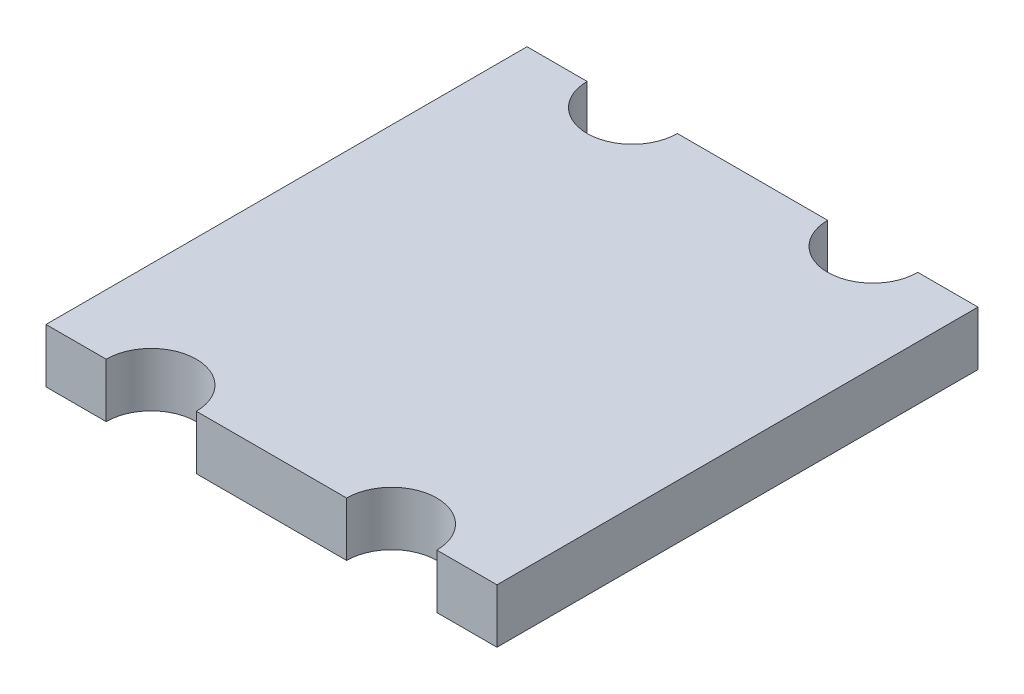
ISO-10303-21;
HEADER;
FILE_DESCRIPTION(('STEP AP214'),'2;1');
FILE_NAME('part.step','',(''),(''),'','','');
FILE_SCHEMA(('AUTOMOTIVE_DESIGN { 1 0 10303 214 1 1 1 1 }'));
ENDSEC;
DATA;
#1=APPLICATION_CONTEXT('core data for automotive mechanical design processes');
#2=APPLICATION_PROTOCOL_DEFINITION('international standard','automotive_design',2000,#1);
#3=PRODUCT_CONTEXT('',#1,'mechanical');
#4=PRODUCT('Part','Part','',(#3));
#5=PRODUCT_RELATED_PRODUCT_CATEGORY('part','',(#4));
#6=PRODUCT_DEFINITION_FORMATION('','',#4);
#7=PRODUCT_DEFINITION_CONTEXT('part definition',#1,'design');
#8=PRODUCT_DEFINITION('design','',#6,#7);
#9=PRODUCT_DEFINITION_SHAPE('','',#8);
#10=(LENGTH_UNIT() NAMED_UNIT(*) SI_UNIT(.MILLI.,.METRE.));
#11=(NAMED_UNIT(*) PLANE_ANGLE_UNIT() SI_UNIT($,.RADIAN.));
#12=(NAMED_UNIT(*) SI_UNIT($,.STERADIAN.) SOLID_ANGLE_UNIT());
#13=UNCERTAINTY_MEASURE_WITH_UNIT(LENGTH_MEASURE(1.E-05),#10,'distance_accuracy_value','');
#14=(GEOMETRIC_REPRESENTATION_CONTEXT(3) GLOBAL_UNCERTAINTY_ASSIGNED_CONTEXT((#13)) GLOBAL_UNIT_ASSIGNED_CONTEXT((#10,
#11,#12)) REPRESENTATION_CONTEXT('',''));
#15=CARTESIAN_POINT('',(0.,0.,0.));
#16=DIRECTION('',(0.,0.,1.));
#17=DIRECTION('',(1.,0.,0.));
#18=AXIS2_PLACEMENT_3D('',#15,#16,#17);
#19=CARTESIAN_POINT('',(1.995,1.03,-32.275));
#20=DIRECTION('',(0.,1.,0.));
#21=DIRECTION('',(-1.,0.,0.));
#22=AXIS2_PLACEMENT_3D('',#19,#20,#21);
#23=PLANE('',#22);
#24=CARTESIAN_POINT('',(1.645,1.03,-32.275));
#25=DIRECTION('',(0.,-1.,0.));
#26=DIRECTION('',(0.,0.,-1.));
#27=AXIS2_PLACEMENT_3D('',#24,#25,#26);
#28=CIRCLE('',#27,0.15);
#29=CARTESIAN_POINT('',(1.795,1.03,-32.275));
#30=VERTEX_POINT('',#29);
#31=CARTESIAN_POINT('',(1.495,1.03,-32.275));
#32=VERTEX_POINT('',#31);
#33=EDGE_CURVE('E21',#30,#32,#28,.T.);
#34=ORIENTED_EDGE('',*,*,#33,.T.);
#35=DIRECTION('',(-1.,0.,0.));
#36=VECTOR('',#35,1.);
#37=CARTESIAN_POINT('',(1.245,1.03,-32.275));
#38=LINE('',#37,#36);
#39=CARTESIAN_POINT('',(0.995,1.03,-32.275));
#40=VERTEX_POINT('',#39);
#41=EDGE_CURVE('E93',#32,#40,#38,.T.);
#42=ORIENTED_EDGE('',*,*,#41,.T.);
#43=CARTESIAN_POINT('',(0.845,1.03,-32.275));
#44=DIRECTION('',(0.,1.,0.));
#45=DIRECTION('',(0.,0.,1.));
#46=AXIS2_PLACEMENT_3D('',#43,#44,#45);
#47=CIRCLE('',#46,0.15);
#48=CARTESIAN_POINT('',(0.695,1.03,-32.275));
#49=VERTEX_POINT('',#48);
#50=EDGE_CURVE('E105',#49,#40,#47,.T.);
#51=ORIENTED_EDGE('',*,*,#50,.F.);
#52=DIRECTION('',(1.,0.,0.));
#53=VECTOR('',#52,1.);
#54=CARTESIAN_POINT('',(1.245,1.03,-32.275));
#55=LINE('',#54,#53);
#56=CARTESIAN_POINT('',(0.495,1.03,-32.275));
#57=VERTEX_POINT('',#56);
#58=EDGE_CURVE('E130',#57,#49,#55,.T.);
#59=ORIENTED_EDGE('',*,*,#58,.F.);
#60=DIRECTION('',(0.,0.,-1.));
#61=VECTOR('',#60,1.);
#62=CARTESIAN_POINT('',(0.495,1.03,-31.475));
#63=LINE('',#62,#61);
#64=CARTESIAN_POINT('',(0.495,1.03,-30.675));
#65=VERTEX_POINT('',#64);
#66=EDGE_CURVE('E127',#65,#57,#63,.T.);
#67=ORIENTED_EDGE('',*,*,#66,.F.);
#68=DIRECTION('',(-1.,0.,0.));
#69=VECTOR('',#68,1.);
#70=CARTESIAN_POINT('',(1.245,1.03,-30.675));
#71=LINE('',#70,#69);
#72=CARTESIAN_POINT('',(0.695,1.03,-30.675));
#73=VERTEX_POINT('',#72);
#74=EDGE_CURVE('E120',#73,#65,#71,.T.);
#75=ORIENTED_EDGE('',*,*,#74,.F.);
#76=CARTESIAN_POINT('',(0.845,1.03,-30.675));
#77=DIRECTION('',(0.,-1.,0.));
#78=DIRECTION('',(0.,0.,-1.));
#79=AXIS2_PLACEMENT_3D('',#76,#77,#78);
#80=CIRCLE('',#79,0.15);
#81=CARTESIAN_POINT('',(0.995,1.03,-30.675));
#82=VERTEX_POINT('',#81);
#83=EDGE_CURVE('E153',#82,#73,#80,.F.);
#84=ORIENTED_EDGE('',*,*,#83,.F.);
#85=DIRECTION('',(-1.,0.,0.));
#86=VECTOR('',#85,1.);
#87=CARTESIAN_POINT('',(1.245,1.03,-30.675));
#88=LINE('',#87,#86);
#89=CARTESIAN_POINT('',(1.495,1.03,-30.675));
#90=VERTEX_POINT('',#89);
#91=EDGE_CURVE('E115',#90,#82,#88,.T.);
#92=ORIENTED_EDGE('',*,*,#91,.F.);
#93=CARTESIAN_POINT('',(1.645,1.03,-30.675));
#94=DIRECTION('',(0.,1.,0.));
#95=DIRECTION('',(0.,0.,1.));
#96=AXIS2_PLACEMENT_3D('',#93,#94,#95);
#97=CIRCLE('',#96,0.15);
#98=CARTESIAN_POINT('',(1.795,1.03,-30.675));
#99=VERTEX_POINT('',#98);
#100=EDGE_CURVE('E118',#99,#90,#97,.T.);
#101=ORIENTED_EDGE('',*,*,#100,.F.);
#102=DIRECTION('',(-1.,0.,0.));
#103=VECTOR('',#102,1.);
#104=CARTESIAN_POINT('',(1.245,1.03,-30.675));
#105=LINE('',#104,#103);
#106=CARTESIAN_POINT('',(1.995,1.03,-30.675));
#107=VERTEX_POINT('',#106);
#108=EDGE_CURVE('E183',#107,#99,#105,.T.);
#109=ORIENTED_EDGE('',*,*,#108,.F.);
#110=DIRECTION('',(0.,0.,1.));
#111=VECTOR('',#110,1.);
#112=CARTESIAN_POINT('',(1.995,1.03,-31.475));
#113=LINE('',#112,#111);
#114=CARTESIAN_POINT('',(1.995,1.03,-32.275));
#115=VERTEX_POINT('',#114);
#116=EDGE_CURVE('E179',#115,#107,#113,.T.);
#117=ORIENTED_EDGE('',*,*,#116,.F.);
#118=DIRECTION('',(-1.,0.,0.));
#119=VECTOR('',#118,1.);
#120=CARTESIAN_POINT('',(1.245,1.03,-32.275));
#121=LINE('',#120,#119);
#122=EDGE_CURVE('E90',#115,#30,#121,.T.);
#123=ORIENTED_EDGE('',*,*,#122,.T.);
#124=EDGE_LOOP('',(#34,#42,#51,#59,#67,#75,#84,#92,#101,#109,#117,#123));
#125=FACE_BOUND('',#124,.T.);
#126=ADVANCED_FACE('F17',(#125),#23,.T.);
#127=CARTESIAN_POINT('',(0.845,0.85,-32.275));
#128=DIRECTION('',(0.,1.,0.));
#129=DIRECTION('',(0.,0.,1.));
#130=AXIS2_PLACEMENT_3D('',#127,#128,#129);
#131=CYLINDRICAL_SURFACE('',#130,0.15);
#132=ORIENTED_EDGE('',*,*,#50,.T.);
#133=DIRECTION('',(0.,1.,0.));
#134=VECTOR('',#133,1.);
#135=CARTESIAN_POINT('',(0.995,0.94,-32.275));
#136=LINE('',#135,#134);
#137=CARTESIAN_POINT('',(0.995,0.85,-32.275));
#138=VERTEX_POINT('',#137);
#139=EDGE_CURVE('E100',#138,#40,#136,.T.);
#140=ORIENTED_EDGE('',*,*,#139,.F.);
#141=CARTESIAN_POINT('',(0.845,0.85,-32.275));
#142=DIRECTION('',(0.,1.,0.));
#143=DIRECTION('',(0.,0.,1.));
#144=AXIS2_PLACEMENT_3D('',#141,#142,#143);
#145=CIRCLE('',#144,0.15);
#146=CARTESIAN_POINT('',(0.695,0.85,-32.275));
#147=VERTEX_POINT('',#146);
#148=EDGE_CURVE('E99',#138,#147,#145,.F.);
#149=ORIENTED_EDGE('',*,*,#148,.T.);
#150=DIRECTION('',(0.,-1.,0.));
#151=VECTOR('',#150,1.);
#152=CARTESIAN_POINT('',(0.695,0.94,-32.275));
#153=LINE('',#152,#151);
#154=EDGE_CURVE('E107',#49,#147,#153,.T.);
#155=ORIENTED_EDGE('',*,*,#154,.F.);
#156=EDGE_LOOP('',(#132,#140,#149,#155));
#157=FACE_BOUND('',#156,.T.);
#158=ADVANCED_FACE('F265',(#157),#131,.F.);
#159=CARTESIAN_POINT('',(1.995,0.85,-32.275));
#160=DIRECTION('',(0.,0.,-1.));
#161=DIRECTION('',(-1.,0.,0.));
#162=AXIS2_PLACEMENT_3D('',#159,#160,#161);
#163=PLANE('',#162);
#164=DIRECTION('',(0.,-1.,0.));
#165=VECTOR('',#164,1.);
#166=CARTESIAN_POINT('',(0.495,0.94,-32.275));
#167=LINE('',#166,#165);
#168=CARTESIAN_POINT('',(0.495,0.85,-32.275));
#169=VERTEX_POINT('',#168);
#170=EDGE_CURVE('E124',#57,#169,#167,.T.);
#171=ORIENTED_EDGE('',*,*,#170,.F.);
#172=ORIENTED_EDGE('',*,*,#58,.T.);
#173=ORIENTED_EDGE('',*,*,#154,.T.);
#174=DIRECTION('',(-1.,0.,0.));
#175=VECTOR('',#174,1.);
#176=CARTESIAN_POINT('',(1.245,0.85,-32.275));
#177=LINE('',#176,#175);
#178=EDGE_CURVE('E150',#147,#169,#177,.T.);
#179=ORIENTED_EDGE('',*,*,#178,.T.);
#180=EDGE_LOOP('',(#171,#172,#173,#179));
#181=FACE_BOUND('',#180,.T.);
#182=ADVANCED_FACE('F262',(#181),#163,.T.);
#183=CARTESIAN_POINT('',(0.495,0.85,-32.275));
#184=DIRECTION('',(-1.,0.,0.));
#185=DIRECTION('',(0.,0.,1.));
#186=AXIS2_PLACEMENT_3D('',#183,#184,#185);
#187=PLANE('',#186);
#188=ORIENTED_EDGE('',*,*,#66,.T.);
#189=ORIENTED_EDGE('',*,*,#170,.T.);
#190=DIRECTION('',(0.,0.,1.));
#191=VECTOR('',#190,1.);
#192=CARTESIAN_POINT('',(0.495,0.85,-31.475));
#193=LINE('',#192,#191);
#194=CARTESIAN_POINT('',(0.495,0.85,-30.675));
#195=VERTEX_POINT('',#194);
#196=EDGE_CURVE('E169',#169,#195,#193,.T.);
#197=ORIENTED_EDGE('',*,*,#196,.T.);
#198=DIRECTION('',(0.,-1.,0.));
#199=VECTOR('',#198,1.);
#200=CARTESIAN_POINT('',(0.495,0.94,-30.675));
#201=LINE('',#200,#199);
#202=EDGE_CURVE('E123',#65,#195,#201,.T.);
#203=ORIENTED_EDGE('',*,*,#202,.F.);
#204=EDGE_LOOP('',(#188,#189,#197,#203));
#205=FACE_BOUND('',#204,.T.);
#206=ADVANCED_FACE('F258',(#205),#187,.T.);
#207=CARTESIAN_POINT('',(0.495,0.85,-30.675));
#208=DIRECTION('',(0.,0.,1.));
#209=DIRECTION('',(1.,0.,0.));
#210=AXIS2_PLACEMENT_3D('',#207,#208,#209);
#211=PLANE('',#210);
#212=ORIENTED_EDGE('',*,*,#202,.T.);
#213=DIRECTION('',(1.,0.,0.));
#214=VECTOR('',#213,1.);
#215=CARTESIAN_POINT('',(1.245,0.85,-30.675));
#216=LINE('',#215,#214);
#217=CARTESIAN_POINT('',(0.695,0.85,-30.675));
#218=VERTEX_POINT('',#217);
#219=EDGE_CURVE('E147',#195,#218,#216,.T.);
#220=ORIENTED_EDGE('',*,*,#219,.T.);
#221=DIRECTION('',(0.,-1.,0.));
#222=VECTOR('',#221,1.);
#223=CARTESIAN_POINT('',(0.695,0.94,-30.675));
#224=LINE('',#223,#222);
#225=EDGE_CURVE('E154',#73,#218,#224,.T.);
#226=ORIENTED_EDGE('',*,*,#225,.F.);
#227=ORIENTED_EDGE('',*,*,#74,.T.);
#228=EDGE_LOOP('',(#212,#220,#226,#227));
#229=FACE_BOUND('',#228,.T.);
#230=ADVANCED_FACE('F210',(#229),#211,.T.);
#231=CARTESIAN_POINT('',(0.845,1.03,-30.675));
#232=DIRECTION('',(0.,-1.,0.));
#233=DIRECTION('',(0.,0.,-1.));
#234=AXIS2_PLACEMENT_3D('',#231,#232,#233);
#235=CYLINDRICAL_SURFACE('',#234,0.15);
#236=ORIENTED_EDGE('',*,*,#83,.T.);
#237=ORIENTED_EDGE('',*,*,#225,.T.);
#238=CARTESIAN_POINT('',(0.845,0.85,-30.675));
#239=DIRECTION('',(0.,-1.,0.));
#240=DIRECTION('',(0.,0.,-1.));
#241=AXIS2_PLACEMENT_3D('',#238,#239,#240);
#242=CIRCLE('',#241,0.15);
#243=CARTESIAN_POINT('',(0.995,0.85,-30.675));
#244=VERTEX_POINT('',#243);
#245=EDGE_CURVE('E144',#218,#244,#242,.T.);
#246=ORIENTED_EDGE('',*,*,#245,.T.);
#247=DIRECTION('',(0.,-1.,0.));
#248=VECTOR('',#247,1.);
#249=CARTESIAN_POINT('',(0.995,0.94,-30.675));
#250=LINE('',#249,#248);
#251=EDGE_CURVE('E119',#82,#244,#250,.T.);
#252=ORIENTED_EDGE('',*,*,#251,.F.);
#253=EDGE_LOOP('',(#236,#237,#246,#252));
#254=FACE_BOUND('',#253,.T.);
#255=ADVANCED_FACE('F208',(#254),#235,.F.);
#256=CARTESIAN_POINT('',(0.495,0.85,-30.675));
#257=DIRECTION('',(0.,0.,1.));
#258=DIRECTION('',(1.,0.,0.));
#259=AXIS2_PLACEMENT_3D('',#256,#257,#258);
#260=PLANE('',#259);
#261=DIRECTION('',(0.,-1.,0.));
#262=VECTOR('',#261,1.);
#263=CARTESIAN_POINT('',(1.495,0.94,-30.6749999999999));
#264=LINE('',#263,#262);
#265=CARTESIAN_POINT('',(1.495,0.85,-30.675));
#266=VERTEX_POINT('',#265);
#267=EDGE_CURVE('E152',#90,#266,#264,.T.);
#268=ORIENTED_EDGE('',*,*,#267,.F.);
#269=ORIENTED_EDGE('',*,*,#91,.T.);
#270=ORIENTED_EDGE('',*,*,#251,.T.);
#271=DIRECTION('',(1.,0.,0.));
#272=VECTOR('',#271,1.);
#273=CARTESIAN_POINT('',(1.245,0.85,-30.675));
#274=LINE('',#273,#272);
#275=EDGE_CURVE('E143',#244,#266,#274,.T.);
#276=ORIENTED_EDGE('',*,*,#275,.T.);
#277=EDGE_LOOP('',(#268,#269,#270,#276));
#278=FACE_BOUND('',#277,.T.);
#279=ADVANCED_FACE('F202',(#278),#260,.T.);
#280=CARTESIAN_POINT('',(1.645,0.85,-30.675));
#281=DIRECTION('',(0.,1.,0.));
#282=DIRECTION('',(0.,0.,1.));
#283=AXIS2_PLACEMENT_3D('',#280,#281,#282);
#284=CYLINDRICAL_SURFACE('',#283,0.15);
#285=ORIENTED_EDGE('',*,*,#100,.T.);
#286=ORIENTED_EDGE('',*,*,#267,.T.);
#287=CARTESIAN_POINT('',(1.645,0.85,-30.675));
#288=DIRECTION('',(0.,1.,0.));
#289=DIRECTION('',(0.,0.,1.));
#290=AXIS2_PLACEMENT_3D('',#287,#288,#289);
#291=CIRCLE('',#290,0.15);
#292=CARTESIAN_POINT('',(1.795,0.85,-30.675));
#293=VERTEX_POINT('',#292);
#294=EDGE_CURVE('E139',#266,#293,#291,.F.);
#295=ORIENTED_EDGE('',*,*,#294,.T.);
#296=DIRECTION('',(0.,-1.,0.));
#297=VECTOR('',#296,1.);
#298=CARTESIAN_POINT('',(1.795,0.94,-30.675));
#299=LINE('',#298,#297);
#300=EDGE_CURVE('E186',#99,#293,#299,.T.);
#301=ORIENTED_EDGE('',*,*,#300,.F.);
#302=EDGE_LOOP('',(#285,#286,#295,#301));
#303=FACE_BOUND('',#302,.T.);
#304=ADVANCED_FACE('F267',(#303),#284,.F.);
#305=CARTESIAN_POINT('',(0.495,0.85,-30.675));
#306=DIRECTION('',(0.,0.,1.));
#307=DIRECTION('',(1.,0.,0.));
#308=AXIS2_PLACEMENT_3D('',#305,#306,#307);
#309=PLANE('',#308);
#310=DIRECTION('',(0.,-1.,0.));
#311=VECTOR('',#310,1.);
#312=CARTESIAN_POINT('',(1.995,0.94,-30.675));
#313=LINE('',#312,#311);
#314=CARTESIAN_POINT('',(1.995,0.85,-30.675));
#315=VERTEX_POINT('',#314);
#316=EDGE_CURVE('E182',#107,#315,#313,.T.);
#317=ORIENTED_EDGE('',*,*,#316,.F.);
#318=ORIENTED_EDGE('',*,*,#108,.T.);
#319=ORIENTED_EDGE('',*,*,#300,.T.);
#320=DIRECTION('',(1.,0.,0.));
#321=VECTOR('',#320,1.);
#322=CARTESIAN_POINT('',(1.245,0.85,-30.675));
#323=LINE('',#322,#321);
#324=EDGE_CURVE('E142',#293,#315,#323,.T.);
#325=ORIENTED_EDGE('',*,*,#324,.T.);
#326=EDGE_LOOP('',(#317,#318,#319,#325));
#327=FACE_BOUND('',#326,.T.);
#328=ADVANCED_FACE('F242',(#327),#309,.T.);
#329=CARTESIAN_POINT('',(1.995,0.85,-30.675));
#330=DIRECTION('',(1.,0.,0.));
#331=DIRECTION('',(0.,0.,-1.));
#332=AXIS2_PLACEMENT_3D('',#329,#330,#331);
#333=PLANE('',#332);
#334=ORIENTED_EDGE('',*,*,#116,.T.);
#335=ORIENTED_EDGE('',*,*,#316,.T.);
#336=DIRECTION('',(0.,0.,-1.));
#337=VECTOR('',#336,1.);
#338=CARTESIAN_POINT('',(1.995,0.85,-31.475));
#339=LINE('',#338,#337);
#340=CARTESIAN_POINT('',(1.995,0.85,-32.275));
#341=VERTEX_POINT('',#340);
#342=EDGE_CURVE('E230',#315,#341,#339,.T.);
#343=ORIENTED_EDGE('',*,*,#342,.T.);
#344=DIRECTION('',(0.,-1.,0.));
#345=VECTOR('',#344,1.);
#346=CARTESIAN_POINT('',(1.995,0.94,-32.275));
#347=LINE('',#346,#345);
#348=EDGE_CURVE('E225',#115,#341,#347,.T.);
#349=ORIENTED_EDGE('',*,*,#348,.F.);
#350=EDGE_LOOP('',(#334,#335,#343,#349));
#351=FACE_BOUND('',#350,.T.);
#352=ADVANCED_FACE('F237',(#351),#333,.T.);
#353=CARTESIAN_POINT('',(1.995,0.85,-32.275));
#354=DIRECTION('',(0.,0.,-1.));
#355=DIRECTION('',(-1.,0.,0.));
#356=AXIS2_PLACEMENT_3D('',#353,#354,#355);
#357=PLANE('',#356);
#358=ORIENTED_EDGE('',*,*,#348,.T.);
#359=DIRECTION('',(-1.,0.,0.));
#360=VECTOR('',#359,1.);
#361=CARTESIAN_POINT('',(1.245,0.85,-32.275));
#362=LINE('',#361,#360);
#363=CARTESIAN_POINT('',(1.795,0.85,-32.275));
#364=VERTEX_POINT('',#363);
#365=EDGE_CURVE('E138',#341,#364,#362,.T.);
#366=ORIENTED_EDGE('',*,*,#365,.T.);
#367=DIRECTION('',(0.,-1.,0.));
#368=VECTOR('',#367,1.);
#369=CARTESIAN_POINT('',(1.795,0.94,-32.275));
#370=LINE('',#369,#368);
#371=EDGE_CURVE('E223',#30,#364,#370,.T.);
#372=ORIENTED_EDGE('',*,*,#371,.F.);
#373=ORIENTED_EDGE('',*,*,#122,.F.);
#374=EDGE_LOOP('',(#358,#366,#372,#373));
#375=FACE_BOUND('',#374,.T.);
#376=ADVANCED_FACE('F249',(#375),#357,.T.);
#377=CARTESIAN_POINT('',(1.645,1.03,-32.275));
#378=DIRECTION('',(0.,-1.,0.));
#379=DIRECTION('',(0.,0.,-1.));
#380=AXIS2_PLACEMENT_3D('',#377,#378,#379);
#381=CYLINDRICAL_SURFACE('',#380,0.15);
#382=ORIENTED_EDGE('',*,*,#33,.F.);
#383=ORIENTED_EDGE('',*,*,#371,.T.);
#384=CARTESIAN_POINT('',(1.645,0.85,-32.275));
#385=DIRECTION('',(0.,-1.,0.));
#386=DIRECTION('',(0.,0.,-1.));
#387=AXIS2_PLACEMENT_3D('',#384,#385,#386);
#388=CIRCLE('',#387,0.15);
#389=CARTESIAN_POINT('',(1.495,0.85,-32.275));
#390=VERTEX_POINT('',#389);
#391=EDGE_CURVE('E27',#364,#390,#388,.T.);
#392=ORIENTED_EDGE('',*,*,#391,.T.);
#393=DIRECTION('',(0.,-1.,0.));
#394=VECTOR('',#393,1.);
#395=CARTESIAN_POINT('',(1.495,0.94,-32.275));
#396=LINE('',#395,#394);
#397=EDGE_CURVE('E35',#32,#390,#396,.T.);
#398=ORIENTED_EDGE('',*,*,#397,.F.);
#399=EDGE_LOOP('',(#382,#383,#392,#398));
#400=FACE_BOUND('',#399,.T.);
#401=ADVANCED_FACE('F97',(#400),#381,.F.);
#402=CARTESIAN_POINT('',(1.995,0.85,-32.275));
#403=DIRECTION('',(0.,0.,-1.));
#404=DIRECTION('',(-1.,0.,0.));
#405=AXIS2_PLACEMENT_3D('',#402,#403,#404);
#406=PLANE('',#405);
#407=ORIENTED_EDGE('',*,*,#397,.T.);
#408=DIRECTION('',(-1.,0.,0.));
#409=VECTOR('',#408,1.);
#410=CARTESIAN_POINT('',(1.245,0.85,-32.275));
#411=LINE('',#410,#409);
#412=EDGE_CURVE('E11',#390,#138,#411,.T.);
#413=ORIENTED_EDGE('',*,*,#412,.T.);
#414=ORIENTED_EDGE('',*,*,#139,.T.);
#415=ORIENTED_EDGE('',*,*,#41,.F.);
#416=EDGE_LOOP('',(#407,#413,#414,#415));
#417=FACE_BOUND('',#416,.T.);
#418=ADVANCED_FACE('F103',(#417),#406,.T.);
#419=CARTESIAN_POINT('',(1.995,0.85,-32.275));
#420=DIRECTION('',(0.,1.,0.));
#421=DIRECTION('',(-1.,0.,0.));
#422=AXIS2_PLACEMENT_3D('',#419,#420,#421);
#423=PLANE('',#422);
#424=ORIENTED_EDGE('',*,*,#391,.F.);
#425=ORIENTED_EDGE('',*,*,#365,.F.);
#426=ORIENTED_EDGE('',*,*,#342,.F.);
#427=ORIENTED_EDGE('',*,*,#324,.F.);
#428=ORIENTED_EDGE('',*,*,#294,.F.);
#429=ORIENTED_EDGE('',*,*,#275,.F.);
#430=ORIENTED_EDGE('',*,*,#245,.F.);
#431=ORIENTED_EDGE('',*,*,#219,.F.);
#432=ORIENTED_EDGE('',*,*,#196,.F.);
#433=ORIENTED_EDGE('',*,*,#178,.F.);
#434=ORIENTED_EDGE('',*,*,#148,.F.);
#435=ORIENTED_EDGE('',*,*,#412,.F.);
#436=EDGE_LOOP('',(#424,#425,#426,#427,#428,#429,#430,#431,#432,#433,#434,#435));
#437=FACE_BOUND('',#436,.T.);
#438=ADVANCED_FACE('F19',(#437),#423,.F.);
#439=CLOSED_SHELL('',(#126,#158,#182,#206,#230,#255,#279,#304,#328,#352,#376,#401,#418,#438));
#440=MANIFOLD_SOLID_BREP('B1',#439);
#441=ADVANCED_BREP_SHAPE_REPRESENTATION('',(#18,#440),#14);
#442=SHAPE_DEFINITION_REPRESENTATION(#9,#441);
ENDSEC;
END-ISO-10303-21;
